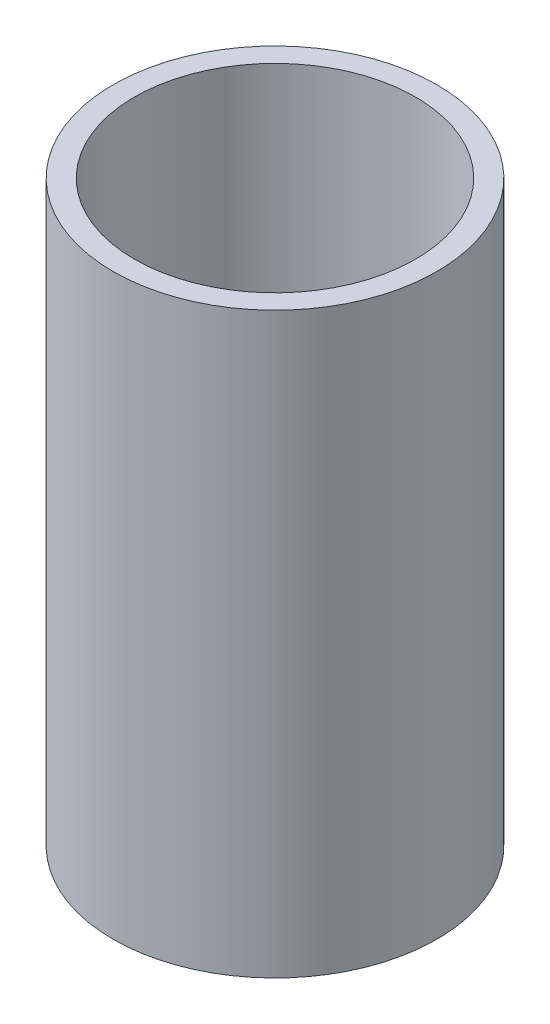
ISO-10303-21;
HEADER;
FILE_DESCRIPTION(('STEP AP214'),'2;1');
FILE_NAME('part.step','',(''),(''),'','','');
FILE_SCHEMA(('AUTOMOTIVE_DESIGN { 1 0 10303 214 1 1 1 1 }'));
ENDSEC;
DATA;
#1=APPLICATION_CONTEXT('core data for automotive mechanical design processes');
#2=APPLICATION_PROTOCOL_DEFINITION('international standard','automotive_design',2000,#1);
#3=PRODUCT_CONTEXT('',#1,'mechanical');
#4=PRODUCT('Part','Part','',(#3));
#5=PRODUCT_RELATED_PRODUCT_CATEGORY('part','',(#4));
#6=PRODUCT_DEFINITION_FORMATION('','',#4);
#7=PRODUCT_DEFINITION_CONTEXT('part definition',#1,'design');
#8=PRODUCT_DEFINITION('design','',#6,#7);
#9=PRODUCT_DEFINITION_SHAPE('','',#8);
#10=(LENGTH_UNIT() NAMED_UNIT(*) SI_UNIT(.MILLI.,.METRE.));
#11=(NAMED_UNIT(*) PLANE_ANGLE_UNIT() SI_UNIT($,.RADIAN.));
#12=(NAMED_UNIT(*) SI_UNIT($,.STERADIAN.) SOLID_ANGLE_UNIT());
#13=UNCERTAINTY_MEASURE_WITH_UNIT(LENGTH_MEASURE(1.E-05),#10,'distance_accuracy_value','');
#14=(GEOMETRIC_REPRESENTATION_CONTEXT(3) GLOBAL_UNCERTAINTY_ASSIGNED_CONTEXT((#13)) GLOBAL_UNIT_ASSIGNED_CONTEXT((#10,
#11,#12)) REPRESENTATION_CONTEXT('',''));
#15=CARTESIAN_POINT('',(0.,0.,0.));
#16=DIRECTION('',(0.,0.,1.));
#17=DIRECTION('',(1.,0.,0.));
#18=AXIS2_PLACEMENT_3D('',#15,#16,#17);
#19=CARTESIAN_POINT('',(0.,142.939144179628,0.));
#20=DIRECTION('',(0.,-1.,0.));
#21=DIRECTION('',(0.,0.,-1.));
#22=AXIS2_PLACEMENT_3D('',#19,#20,#21);
#23=CYLINDRICAL_SURFACE('',#22,40.);
#24=CARTESIAN_POINT('',(0.,142.939144179628,0.));
#25=DIRECTION('',(0.,1.,0.));
#26=DIRECTION('',(0.,0.,1.));
#27=AXIS2_PLACEMENT_3D('',#24,#25,#26);
#28=CIRCLE('',#27,40.);
#29=CARTESIAN_POINT('',(0.,142.939144179628,40.));
#30=VERTEX_POINT('',#29);
#31=EDGE_CURVE('E10',#30,#30,#28,.T.);
#32=ORIENTED_EDGE('',*,*,#31,.F.);
#33=EDGE_LOOP('',(#32));
#34=FACE_BOUND('',#33,.T.);
#35=CARTESIAN_POINT('',(0.,0.,0.));
#36=DIRECTION('',(0.,1.,0.));
#37=DIRECTION('',(0.,0.,1.));
#38=AXIS2_PLACEMENT_3D('',#35,#36,#37);
#39=CIRCLE('',#38,40.);
#40=CARTESIAN_POINT('',(0.,0.,40.));
#41=VERTEX_POINT('',#40);
#42=EDGE_CURVE('E37',#41,#41,#39,.T.);
#43=ORIENTED_EDGE('',*,*,#42,.T.);
#44=EDGE_LOOP('',(#43));
#45=FACE_BOUND('',#44,.T.);
#46=ADVANCED_FACE('F40',(#34,#45),#23,.T.);
#47=CARTESIAN_POINT('',(0.,142.939144179628,0.));
#48=DIRECTION('',(0.,1.,0.));
#49=DIRECTION('',(0.,0.,1.));
#50=AXIS2_PLACEMENT_3D('',#47,#48,#49);
#51=PLANE('',#50);
#52=CARTESIAN_POINT('',(0.,142.939144179628,0.));
#53=DIRECTION('',(0.,1.,0.));
#54=DIRECTION('',(0.,0.,1.));
#55=AXIS2_PLACEMENT_3D('',#52,#53,#54);
#56=CIRCLE('',#55,34.7362962932053);
#57=CARTESIAN_POINT('',(0.,142.939144179628,34.7362962932053));
#58=VERTEX_POINT('',#57);
#59=EDGE_CURVE('E50',#58,#58,#56,.T.);
#60=ORIENTED_EDGE('',*,*,#59,.F.);
#61=EDGE_LOOP('',(#60));
#62=FACE_BOUND('',#61,.T.);
#63=ORIENTED_EDGE('',*,*,#31,.T.);
#64=EDGE_LOOP('',(#63));
#65=FACE_BOUND('',#64,.T.);
#66=ADVANCED_FACE('F59',(#62,#65),#51,.T.);
#67=CARTESIAN_POINT('',(0.,0.,0.));
#68=DIRECTION('',(0.,1.,0.));
#69=DIRECTION('',(0.,0.,1.));
#70=AXIS2_PLACEMENT_3D('',#67,#68,#69);
#71=PLANE('',#70);
#72=CARTESIAN_POINT('',(0.,0.,0.));
#73=DIRECTION('',(0.,1.,0.));
#74=DIRECTION('',(0.,0.,1.));
#75=AXIS2_PLACEMENT_3D('',#72,#73,#74);
#76=CIRCLE('',#75,34.7362962932053);
#77=CARTESIAN_POINT('',(0.,0.,34.7362962932053));
#78=VERTEX_POINT('',#77);
#79=EDGE_CURVE('E47',#78,#78,#76,.T.);
#80=ORIENTED_EDGE('',*,*,#79,.T.);
#81=EDGE_LOOP('',(#80));
#82=FACE_BOUND('',#81,.T.);
#83=ORIENTED_EDGE('',*,*,#42,.F.);
#84=EDGE_LOOP('',(#83));
#85=FACE_BOUND('',#84,.T.);
#86=ADVANCED_FACE('F58',(#82,#85),#71,.F.);
#87=CARTESIAN_POINT('',(0.,142.939144179628,0.));
#88=DIRECTION('',(0.,-1.,0.));
#89=DIRECTION('',(0.,0.,-1.));
#90=AXIS2_PLACEMENT_3D('',#87,#88,#89);
#91=CYLINDRICAL_SURFACE('',#90,34.7362962932053);
#92=ORIENTED_EDGE('',*,*,#59,.T.);
#93=EDGE_LOOP('',(#92));
#94=FACE_BOUND('',#93,.T.);
#95=ORIENTED_EDGE('',*,*,#79,.F.);
#96=EDGE_LOOP('',(#95));
#97=FACE_BOUND('',#96,.T.);
#98=ADVANCED_FACE('F54',(#94,#97),#91,.F.);
#99=CLOSED_SHELL('',(#46,#66,#86,#98));
#100=MANIFOLD_SOLID_BREP('B2',#99);
#101=ADVANCED_BREP_SHAPE_REPRESENTATION('',(#18,#100),#14);
#102=SHAPE_DEFINITION_REPRESENTATION(#9,#101);
ENDSEC;
END-ISO-10303-21;
